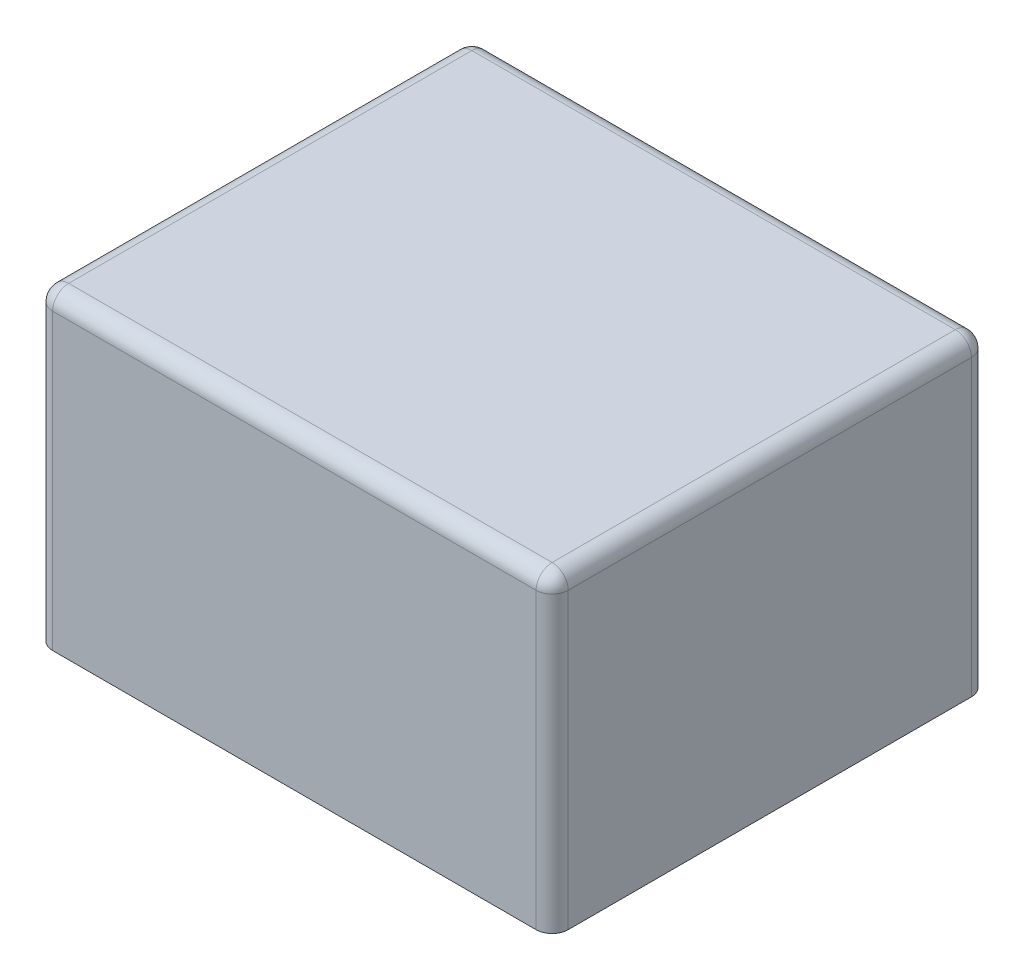
ISO-10303-21;
HEADER;
FILE_DESCRIPTION(('STEP AP214'),'2;1');
FILE_NAME('part.step','',(''),(''),'','','');
FILE_SCHEMA(('AUTOMOTIVE_DESIGN { 1 0 10303 214 1 1 1 1 }'));
ENDSEC;
DATA;
#1=APPLICATION_CONTEXT('core data for automotive mechanical design processes');
#2=APPLICATION_PROTOCOL_DEFINITION('international standard','automotive_design',2000,#1);
#3=PRODUCT_CONTEXT('',#1,'mechanical');
#4=PRODUCT('Part','Part','',(#3));
#5=PRODUCT_RELATED_PRODUCT_CATEGORY('part','',(#4));
#6=PRODUCT_DEFINITION_FORMATION('','',#4);
#7=PRODUCT_DEFINITION_CONTEXT('part definition',#1,'design');
#8=PRODUCT_DEFINITION('design','',#6,#7);
#9=PRODUCT_DEFINITION_SHAPE('','',#8);
#10=(LENGTH_UNIT() NAMED_UNIT(*) SI_UNIT(.MILLI.,.METRE.));
#11=(NAMED_UNIT(*) PLANE_ANGLE_UNIT() SI_UNIT($,.RADIAN.));
#12=(NAMED_UNIT(*) SI_UNIT($,.STERADIAN.) SOLID_ANGLE_UNIT());
#13=UNCERTAINTY_MEASURE_WITH_UNIT(LENGTH_MEASURE(1.E-05),#10,'distance_accuracy_value','');
#14=(GEOMETRIC_REPRESENTATION_CONTEXT(3) GLOBAL_UNCERTAINTY_ASSIGNED_CONTEXT((#13)) GLOBAL_UNIT_ASSIGNED_CONTEXT((#10,
#11,#12)) REPRESENTATION_CONTEXT('',''));
#15=CARTESIAN_POINT('',(0.,0.,0.));
#16=DIRECTION('',(0.,0.,1.));
#17=DIRECTION('',(1.,0.,0.));
#18=AXIS2_PLACEMENT_3D('',#15,#16,#17);
#19=CARTESIAN_POINT('',(11.05,-3.,-23.55));
#20=DIRECTION('',(0.,-1.,0.));
#21=DIRECTION('',(0.,0.,-1.));
#22=AXIS2_PLACEMENT_3D('',#19,#20,#21);
#23=PLANE('',#22);
#24=CARTESIAN_POINT('',(11.05,-3.,-23.55));
#25=DIRECTION('',(0.,-1.,0.));
#26=DIRECTION('',(0.,0.,-1.));
#27=AXIS2_PLACEMENT_3D('',#24,#25,#26);
#28=CIRCLE('',#27,0.5);
#29=CARTESIAN_POINT('',(11.05,-3.,-23.05));
#30=VERTEX_POINT('',#29);
#31=CARTESIAN_POINT('',(11.05,-3.,-24.05));
#32=VERTEX_POINT('',#31);
#33=EDGE_CURVE('E11',#30,#32,#28,.T.);
#34=ORIENTED_EDGE('',*,*,#33,.T.);
#35=CARTESIAN_POINT('',(11.05,-3.,-23.55));
#36=DIRECTION('',(0.,-1.,0.));
#37=DIRECTION('',(0.,0.,-1.));
#38=AXIS2_PLACEMENT_3D('',#35,#36,#37);
#39=CIRCLE('',#38,0.5);
#40=EDGE_CURVE('E162',#32,#30,#39,.T.);
#41=ORIENTED_EDGE('',*,*,#40,.T.);
#42=EDGE_LOOP('',(#34,#41));
#43=FACE_BOUND('',#42,.T.);
#44=ADVANCED_FACE('F17',(#43),#23,.T.);
#45=CARTESIAN_POINT('',(11.05,-3.,-23.55));
#46=DIRECTION('',(0.,1.,0.));
#47=DIRECTION('',(0.,0.,1.));
#48=AXIS2_PLACEMENT_3D('',#45,#46,#47);
#49=CYLINDRICAL_SURFACE('',#48,0.5);
#50=DIRECTION('',(0.,1.,0.));
#51=VECTOR('',#50,1.);
#52=CARTESIAN_POINT('',(11.05,-3.,-24.05));
#53=LINE('',#52,#51);
#54=CARTESIAN_POINT('',(11.05,0.,-24.05));
#55=VERTEX_POINT('',#54);
#56=EDGE_CURVE('E167',#32,#55,#53,.T.);
#57=ORIENTED_EDGE('',*,*,#56,.F.);
#58=ORIENTED_EDGE('',*,*,#33,.F.);
#59=DIRECTION('',(0.,1.,0.));
#60=VECTOR('',#59,1.);
#61=CARTESIAN_POINT('',(11.05,-3.,-23.05));
#62=LINE('',#61,#60);
#63=CARTESIAN_POINT('',(11.05,0.,-23.05));
#64=VERTEX_POINT('',#63);
#65=EDGE_CURVE('E177',#30,#64,#62,.T.);
#66=ORIENTED_EDGE('',*,*,#65,.T.);
#67=CARTESIAN_POINT('',(11.05,0.,-23.55));
#68=DIRECTION('',(0.,-1.,0.));
#69=DIRECTION('',(0.,0.,-1.));
#70=AXIS2_PLACEMENT_3D('',#67,#68,#69);
#71=CIRCLE('',#70,0.5);
#72=EDGE_CURVE('E169',#64,#55,#71,.T.);
#73=ORIENTED_EDGE('',*,*,#72,.T.);
#74=EDGE_LOOP('',(#57,#58,#66,#73));
#75=FACE_BOUND('',#74,.T.);
#76=ADVANCED_FACE('F168',(#75),#49,.T.);
#77=CARTESIAN_POINT('',(21.05,-3.,-23.55));
#78=DIRECTION('',(0.,-1.,0.));
#79=DIRECTION('',(0.,0.,-1.));
#80=AXIS2_PLACEMENT_3D('',#77,#78,#79);
#81=PLANE('',#80);
#82=CARTESIAN_POINT('',(21.05,-3.,-23.55));
#83=DIRECTION('',(0.,-1.,0.));
#84=DIRECTION('',(0.,0.,-1.));
#85=AXIS2_PLACEMENT_3D('',#82,#83,#84);
#86=CIRCLE('',#85,0.5);
#87=CARTESIAN_POINT('',(21.05,-3.,-23.05));
#88=VERTEX_POINT('',#87);
#89=CARTESIAN_POINT('',(21.05,-3.,-24.05));
#90=VERTEX_POINT('',#89);
#91=EDGE_CURVE('E28',#88,#90,#86,.T.);
#92=ORIENTED_EDGE('',*,*,#91,.T.);
#93=CARTESIAN_POINT('',(21.05,-3.,-23.55));
#94=DIRECTION('',(0.,-1.,0.));
#95=DIRECTION('',(0.,0.,-1.));
#96=AXIS2_PLACEMENT_3D('',#93,#94,#95);
#97=CIRCLE('',#96,0.5);
#98=EDGE_CURVE('E226',#90,#88,#97,.T.);
#99=ORIENTED_EDGE('',*,*,#98,.T.);
#100=EDGE_LOOP('',(#92,#99));
#101=FACE_BOUND('',#100,.T.);
#102=ADVANCED_FACE('F421',(#101),#81,.T.);
#103=CARTESIAN_POINT('',(21.05,-3.,-23.55));
#104=DIRECTION('',(0.,1.,0.));
#105=DIRECTION('',(0.,0.,1.));
#106=AXIS2_PLACEMENT_3D('',#103,#104,#105);
#107=CYLINDRICAL_SURFACE('',#106,0.5);
#108=DIRECTION('',(0.,1.,0.));
#109=VECTOR('',#108,1.);
#110=CARTESIAN_POINT('',(21.05,-3.,-24.05));
#111=LINE('',#110,#109);
#112=CARTESIAN_POINT('',(21.05,0.,-24.05));
#113=VERTEX_POINT('',#112);
#114=EDGE_CURVE('E268',#90,#113,#111,.T.);
#115=ORIENTED_EDGE('',*,*,#114,.F.);
#116=ORIENTED_EDGE('',*,*,#91,.F.);
#117=DIRECTION('',(0.,1.,0.));
#118=VECTOR('',#117,1.);
#119=CARTESIAN_POINT('',(21.05,-3.,-23.05));
#120=LINE('',#119,#118);
#121=CARTESIAN_POINT('',(21.05,0.,-23.05));
#122=VERTEX_POINT('',#121);
#123=EDGE_CURVE('E343',#88,#122,#120,.T.);
#124=ORIENTED_EDGE('',*,*,#123,.T.);
#125=CARTESIAN_POINT('',(21.05,0.,-23.55));
#126=DIRECTION('',(0.,-1.,0.));
#127=DIRECTION('',(0.,0.,-1.));
#128=AXIS2_PLACEMENT_3D('',#125,#126,#127);
#129=CIRCLE('',#128,0.5);
#130=EDGE_CURVE('E188',#122,#113,#129,.T.);
#131=ORIENTED_EDGE('',*,*,#130,.T.);
#132=EDGE_LOOP('',(#115,#116,#124,#131));
#133=FACE_BOUND('',#132,.T.);
#134=ADVANCED_FACE('F416',(#133),#107,.T.);
#135=CARTESIAN_POINT('',(26.05,-3.,-3.55));
#136=DIRECTION('',(0.,-1.,0.));
#137=DIRECTION('',(0.,0.,-1.));
#138=AXIS2_PLACEMENT_3D('',#135,#136,#137);
#139=PLANE('',#138);
#140=CARTESIAN_POINT('',(26.05,-3.,-3.55));
#141=DIRECTION('',(0.,-1.,0.));
#142=DIRECTION('',(0.,0.,-1.));
#143=AXIS2_PLACEMENT_3D('',#140,#141,#142);
#144=CIRCLE('',#143,0.5);
#145=CARTESIAN_POINT('',(26.05,-3.,-3.05));
#146=VERTEX_POINT('',#145);
#147=CARTESIAN_POINT('',(26.05,-3.,-4.05));
#148=VERTEX_POINT('',#147);
#149=EDGE_CURVE('E303',#146,#148,#144,.T.);
#150=ORIENTED_EDGE('',*,*,#149,.T.);
#151=CARTESIAN_POINT('',(26.05,-3.,-3.55));
#152=DIRECTION('',(0.,-1.,0.));
#153=DIRECTION('',(0.,0.,-1.));
#154=AXIS2_PLACEMENT_3D('',#151,#152,#153);
#155=CIRCLE('',#154,0.5);
#156=EDGE_CURVE('E352',#148,#146,#155,.T.);
#157=ORIENTED_EDGE('',*,*,#156,.T.);
#158=EDGE_LOOP('',(#150,#157));
#159=FACE_BOUND('',#158,.T.);
#160=ADVANCED_FACE('F429',(#159),#139,.T.);
#161=CARTESIAN_POINT('',(26.05,-3.,-3.55));
#162=DIRECTION('',(0.,1.,0.));
#163=DIRECTION('',(0.,0.,1.));
#164=AXIS2_PLACEMENT_3D('',#161,#162,#163);
#165=CYLINDRICAL_SURFACE('',#164,0.5);
#166=DIRECTION('',(0.,1.,0.));
#167=VECTOR('',#166,1.);
#168=CARTESIAN_POINT('',(26.05,-3.,-4.05));
#169=LINE('',#168,#167);
#170=CARTESIAN_POINT('',(26.05,0.,-4.05));
#171=VERTEX_POINT('',#170);
#172=EDGE_CURVE('E21',#148,#171,#169,.T.);
#173=ORIENTED_EDGE('',*,*,#172,.F.);
#174=ORIENTED_EDGE('',*,*,#149,.F.);
#175=DIRECTION('',(0.,1.,0.));
#176=VECTOR('',#175,1.);
#177=CARTESIAN_POINT('',(26.05,-3.,-3.05));
#178=LINE('',#177,#176);
#179=CARTESIAN_POINT('',(26.05,0.,-3.05));
#180=VERTEX_POINT('',#179);
#181=EDGE_CURVE('E242',#146,#180,#178,.T.);
#182=ORIENTED_EDGE('',*,*,#181,.T.);
#183=CARTESIAN_POINT('',(26.05,0.,-3.55));
#184=DIRECTION('',(0.,-1.,0.));
#185=DIRECTION('',(0.,0.,-1.));
#186=AXIS2_PLACEMENT_3D('',#183,#184,#185);
#187=CIRCLE('',#186,0.5);
#188=EDGE_CURVE('E206',#180,#171,#187,.T.);
#189=ORIENTED_EDGE('',*,*,#188,.T.);
#190=EDGE_LOOP('',(#173,#174,#182,#189));
#191=FACE_BOUND('',#190,.T.);
#192=ADVANCED_FACE('F401',(#191),#165,.T.);
#193=CARTESIAN_POINT('',(6.05,-3.,-3.55));
#194=DIRECTION('',(0.,-1.,0.));
#195=DIRECTION('',(0.,0.,-1.));
#196=AXIS2_PLACEMENT_3D('',#193,#194,#195);
#197=PLANE('',#196);
#198=CARTESIAN_POINT('',(6.05,-3.,-3.55));
#199=DIRECTION('',(0.,-1.,0.));
#200=DIRECTION('',(0.,0.,-1.));
#201=AXIS2_PLACEMENT_3D('',#198,#199,#200);
#202=CIRCLE('',#201,0.5);
#203=CARTESIAN_POINT('',(6.05,-3.,-3.05));
#204=VERTEX_POINT('',#203);
#205=CARTESIAN_POINT('',(6.05,-3.,-4.05));
#206=VERTEX_POINT('',#205);
#207=EDGE_CURVE('E299',#204,#206,#202,.T.);
#208=ORIENTED_EDGE('',*,*,#207,.T.);
#209=CARTESIAN_POINT('',(6.05,-3.,-3.55));
#210=DIRECTION('',(0.,-1.,0.));
#211=DIRECTION('',(0.,0.,-1.));
#212=AXIS2_PLACEMENT_3D('',#209,#210,#211);
#213=CIRCLE('',#212,0.5);
#214=EDGE_CURVE('E276',#206,#204,#213,.T.);
#215=ORIENTED_EDGE('',*,*,#214,.T.);
#216=EDGE_LOOP('',(#208,#215));
#217=FACE_BOUND('',#216,.T.);
#218=ADVANCED_FACE('F453',(#217),#197,.T.);
#219=CARTESIAN_POINT('',(6.05,-3.,-3.55));
#220=DIRECTION('',(0.,1.,0.));
#221=DIRECTION('',(0.,0.,1.));
#222=AXIS2_PLACEMENT_3D('',#219,#220,#221);
#223=CYLINDRICAL_SURFACE('',#222,0.5);
#224=DIRECTION('',(0.,1.,0.));
#225=VECTOR('',#224,1.);
#226=CARTESIAN_POINT('',(6.05,-3.,-4.05));
#227=LINE('',#226,#225);
#228=CARTESIAN_POINT('',(6.05,0.,-4.05));
#229=VERTEX_POINT('',#228);
#230=EDGE_CURVE('E285',#206,#229,#227,.T.);
#231=ORIENTED_EDGE('',*,*,#230,.F.);
#232=ORIENTED_EDGE('',*,*,#207,.F.);
#233=DIRECTION('',(0.,1.,0.));
#234=VECTOR('',#233,1.);
#235=CARTESIAN_POINT('',(6.05,-3.,-3.05));
#236=LINE('',#235,#234);
#237=CARTESIAN_POINT('',(6.05,0.,-3.05));
#238=VERTEX_POINT('',#237);
#239=EDGE_CURVE('E255',#204,#238,#236,.T.);
#240=ORIENTED_EDGE('',*,*,#239,.T.);
#241=CARTESIAN_POINT('',(6.05,0.,-3.55));
#242=DIRECTION('',(0.,-1.,0.));
#243=DIRECTION('',(0.,0.,-1.));
#244=AXIS2_PLACEMENT_3D('',#241,#242,#243);
#245=CIRCLE('',#244,0.5);
#246=EDGE_CURVE('E185',#238,#229,#245,.T.);
#247=ORIENTED_EDGE('',*,*,#246,.T.);
#248=EDGE_LOOP('',(#231,#232,#240,#247));
#249=FACE_BOUND('',#248,.T.);
#250=ADVANCED_FACE('F446',(#249),#223,.T.);
#251=CARTESIAN_POINT('',(0.,18.3,-26.1));
#252=DIRECTION('',(-1.,0.,0.));
#253=DIRECTION('',(0.,0.,1.));
#254=AXIS2_PLACEMENT_3D('',#251,#252,#253);
#255=CYLINDRICAL_SURFACE('',#254,1.);
#256=CARTESIAN_POINT('',(31.1,18.3,-26.1));
#257=DIRECTION('',(-1.,0.,0.));
#258=DIRECTION('',(0.,0.,-1.));
#259=AXIS2_PLACEMENT_3D('',#256,#257,#258);
#260=CIRCLE('',#259,1.);
#261=CARTESIAN_POINT('',(31.1,19.3,-26.1));
#262=VERTEX_POINT('',#261);
#263=CARTESIAN_POINT('',(31.1,18.3,-27.1));
#264=VERTEX_POINT('',#263);
#265=EDGE_CURVE('E292',#262,#264,#260,.T.);
#266=ORIENTED_EDGE('',*,*,#265,.T.);
#267=DIRECTION('',(1.,0.,0.));
#268=VECTOR('',#267,1.);
#269=CARTESIAN_POINT('',(0.,18.3,-27.1));
#270=LINE('',#269,#268);
#271=CARTESIAN_POINT('',(1.,18.3,-27.1));
#272=VERTEX_POINT('',#271);
#273=EDGE_CURVE('E254',#272,#264,#270,.T.);
#274=ORIENTED_EDGE('',*,*,#273,.F.);
#275=CARTESIAN_POINT('',(1.,18.3,-26.1));
#276=DIRECTION('',(1.,0.,0.));
#277=DIRECTION('',(0.,0.,1.));
#278=AXIS2_PLACEMENT_3D('',#275,#276,#277);
#279=CIRCLE('',#278,1.);
#280=CARTESIAN_POINT('',(1.,19.3,-26.1));
#281=VERTEX_POINT('',#280);
#282=EDGE_CURVE('E295',#272,#281,#279,.T.);
#283=ORIENTED_EDGE('',*,*,#282,.T.);
#284=DIRECTION('',(-1.,0.,0.));
#285=VECTOR('',#284,1.);
#286=CARTESIAN_POINT('',(0.,19.3,-26.1));
#287=LINE('',#286,#285);
#288=EDGE_CURVE('E214',#262,#281,#287,.T.);
#289=ORIENTED_EDGE('',*,*,#288,.F.);
#290=EDGE_LOOP('',(#266,#274,#283,#289));
#291=FACE_BOUND('',#290,.T.);
#292=ADVANCED_FACE('F442',(#291),#255,.T.);
#293=CARTESIAN_POINT('',(1.,18.3,-26.1));
#294=DIRECTION('',(0.,1.,0.));
#295=DIRECTION('',(0.,0.,1.));
#296=AXIS2_PLACEMENT_3D('',#293,#294,#295);
#297=SPHERICAL_SURFACE('',#296,1.);
#298=CARTESIAN_POINT('',(1.,18.3,-26.1));
#299=DIRECTION('',(0.,1.,0.));
#300=DIRECTION('',(0.,0.,1.));
#301=AXIS2_PLACEMENT_3D('',#298,#299,#300);
#302=CIRCLE('',#301,1.);
#303=CARTESIAN_POINT('',(0.,18.3,-26.1));
#304=VERTEX_POINT('',#303);
#305=EDGE_CURVE('E296',#272,#304,#302,.T.);
#306=ORIENTED_EDGE('',*,*,#305,.T.);
#307=CARTESIAN_POINT('',(1.,18.3,-26.1));
#308=DIRECTION('',(0.,0.,-1.));
#309=DIRECTION('',(-1.,0.,0.));
#310=AXIS2_PLACEMENT_3D('',#307,#308,#309);
#311=CIRCLE('',#310,1.);
#312=EDGE_CURVE('E230',#304,#281,#311,.T.);
#313=ORIENTED_EDGE('',*,*,#312,.T.);
#314=ORIENTED_EDGE('',*,*,#282,.F.);
#315=EDGE_LOOP('',(#306,#313,#314));
#316=FACE_BOUND('',#315,.T.);
#317=ADVANCED_FACE('F445',(#316),#297,.T.);
#318=CARTESIAN_POINT('',(31.1,18.3,-26.1));
#319=DIRECTION('',(0.,1.,0.));
#320=DIRECTION('',(0.,0.,-1.));
#321=AXIS2_PLACEMENT_3D('',#318,#319,#320);
#322=SPHERICAL_SURFACE('',#321,1.);
#323=CARTESIAN_POINT('',(31.1,18.3,-26.1));
#324=DIRECTION('',(0.,0.,-1.));
#325=DIRECTION('',(-1.,0.,0.));
#326=AXIS2_PLACEMENT_3D('',#323,#324,#325);
#327=CIRCLE('',#326,1.);
#328=CARTESIAN_POINT('',(32.1,18.3,-26.1));
#329=VERTEX_POINT('',#328);
#330=EDGE_CURVE('E227',#262,#329,#327,.T.);
#331=ORIENTED_EDGE('',*,*,#330,.T.);
#332=CARTESIAN_POINT('',(31.1,18.3,-26.1));
#333=DIRECTION('',(0.,1.,0.));
#334=DIRECTION('',(0.,0.,1.));
#335=AXIS2_PLACEMENT_3D('',#332,#333,#334);
#336=CIRCLE('',#335,1.);
#337=EDGE_CURVE('E231',#329,#264,#336,.T.);
#338=ORIENTED_EDGE('',*,*,#337,.T.);
#339=ORIENTED_EDGE('',*,*,#265,.F.);
#340=EDGE_LOOP('',(#331,#338,#339));
#341=FACE_BOUND('',#340,.T.);
#342=ADVANCED_FACE('F448',(#341),#322,.T.);
#343=CARTESIAN_POINT('',(1.,19.3,-26.1));
#344=DIRECTION('',(0.,-1.,0.));
#345=DIRECTION('',(0.,0.,-1.));
#346=AXIS2_PLACEMENT_3D('',#343,#344,#345);
#347=CYLINDRICAL_SURFACE('',#346,1.);
#348=CARTESIAN_POINT('',(1.,0.,-26.1));
#349=DIRECTION('',(0.,-1.,0.));
#350=DIRECTION('',(0.,0.,-1.));
#351=AXIS2_PLACEMENT_3D('',#348,#349,#350);
#352=CIRCLE('',#351,1.);
#353=CARTESIAN_POINT('',(0.,0.,-26.1));
#354=VERTEX_POINT('',#353);
#355=CARTESIAN_POINT('',(1.,0.,-27.1));
#356=VERTEX_POINT('',#355);
#357=EDGE_CURVE('E195',#354,#356,#352,.T.);
#358=ORIENTED_EDGE('',*,*,#357,.F.);
#359=DIRECTION('',(0.,-1.,0.));
#360=VECTOR('',#359,1.);
#361=CARTESIAN_POINT('',(0.,19.3,-26.1));
#362=LINE('',#361,#360);
#363=EDGE_CURVE('E264',#304,#354,#362,.T.);
#364=ORIENTED_EDGE('',*,*,#363,.F.);
#365=ORIENTED_EDGE('',*,*,#305,.F.);
#366=DIRECTION('',(0.,1.,0.));
#367=VECTOR('',#366,1.);
#368=CARTESIAN_POINT('',(1.,19.3,-27.1));
#369=LINE('',#368,#367);
#370=EDGE_CURVE('E289',#356,#272,#369,.T.);
#371=ORIENTED_EDGE('',*,*,#370,.F.);
#372=EDGE_LOOP('',(#358,#364,#365,#371));
#373=FACE_BOUND('',#372,.T.);
#374=ADVANCED_FACE('F451',(#373),#347,.T.);
#375=CARTESIAN_POINT('',(1.,18.3,0.));
#376=DIRECTION('',(0.,0.,1.));
#377=DIRECTION('',(1.,0.,0.));
#378=AXIS2_PLACEMENT_3D('',#375,#376,#377);
#379=CYLINDRICAL_SURFACE('',#378,1.);
#380=CARTESIAN_POINT('',(1.,18.3,-1.));
#381=DIRECTION('',(0.,0.,-1.));
#382=DIRECTION('',(1.,0.,0.));
#383=AXIS2_PLACEMENT_3D('',#380,#381,#382);
#384=CIRCLE('',#383,1.);
#385=CARTESIAN_POINT('',(0.,18.3,-1.));
#386=VERTEX_POINT('',#385);
#387=CARTESIAN_POINT('',(1.,19.3,-1.));
#388=VERTEX_POINT('',#387);
#389=EDGE_CURVE('E42',#386,#388,#384,.T.);
#390=ORIENTED_EDGE('',*,*,#389,.T.);
#391=DIRECTION('',(0.,0.,1.));
#392=VECTOR('',#391,1.);
#393=CARTESIAN_POINT('',(1.,19.3,0.));
#394=LINE('',#393,#392);
#395=EDGE_CURVE('E218',#281,#388,#394,.T.);
#396=ORIENTED_EDGE('',*,*,#395,.F.);
#397=ORIENTED_EDGE('',*,*,#312,.F.);
#398=DIRECTION('',(0.,0.,-1.));
#399=VECTOR('',#398,1.);
#400=CARTESIAN_POINT('',(0.,18.3,0.));
#401=LINE('',#400,#399);
#402=EDGE_CURVE('E259',#386,#304,#401,.T.);
#403=ORIENTED_EDGE('',*,*,#402,.F.);
#404=EDGE_LOOP('',(#390,#396,#397,#403));
#405=FACE_BOUND('',#404,.T.);
#406=ADVANCED_FACE('F459',(#405),#379,.T.);
#407=CARTESIAN_POINT('',(31.1,18.3,0.));
#408=DIRECTION('',(0.,0.,-1.));
#409=DIRECTION('',(-1.,0.,0.));
#410=AXIS2_PLACEMENT_3D('',#407,#408,#409);
#411=CYLINDRICAL_SURFACE('',#410,1.);
#412=CARTESIAN_POINT('',(31.1,18.3,-1.));
#413=DIRECTION('',(0.,0.,-1.));
#414=DIRECTION('',(1.,0.,0.));
#415=AXIS2_PLACEMENT_3D('',#412,#413,#414);
#416=CIRCLE('',#415,1.);
#417=CARTESIAN_POINT('',(31.1,19.3,-1.));
#418=VERTEX_POINT('',#417);
#419=CARTESIAN_POINT('',(32.1,18.3,-1.));
#420=VERTEX_POINT('',#419);
#421=EDGE_CURVE('E223',#418,#420,#416,.T.);
#422=ORIENTED_EDGE('',*,*,#421,.T.);
#423=DIRECTION('',(0.,0.,1.));
#424=VECTOR('',#423,1.);
#425=CARTESIAN_POINT('',(32.1,18.3,0.));
#426=LINE('',#425,#424);
#427=EDGE_CURVE('E203',#329,#420,#426,.T.);
#428=ORIENTED_EDGE('',*,*,#427,.F.);
#429=ORIENTED_EDGE('',*,*,#330,.F.);
#430=DIRECTION('',(0.,0.,-1.));
#431=VECTOR('',#430,1.);
#432=CARTESIAN_POINT('',(31.1,19.3,0.));
#433=LINE('',#432,#431);
#434=EDGE_CURVE('E219',#418,#262,#433,.T.);
#435=ORIENTED_EDGE('',*,*,#434,.F.);
#436=EDGE_LOOP('',(#422,#428,#429,#435));
#437=FACE_BOUND('',#436,.T.);
#438=ADVANCED_FACE('F461',(#437),#411,.T.);
#439=CARTESIAN_POINT('',(31.1,19.3,-26.1));
#440=DIRECTION('',(0.,-1.,0.));
#441=DIRECTION('',(0.,0.,-1.));
#442=AXIS2_PLACEMENT_3D('',#439,#440,#441);
#443=CYLINDRICAL_SURFACE('',#442,1.);
#444=CARTESIAN_POINT('',(31.1,0.,-26.1));
#445=DIRECTION('',(0.,-1.,0.));
#446=DIRECTION('',(0.,0.,-1.));
#447=AXIS2_PLACEMENT_3D('',#444,#445,#446);
#448=CIRCLE('',#447,1.);
#449=CARTESIAN_POINT('',(31.1,0.,-27.1));
#450=VERTEX_POINT('',#449);
#451=CARTESIAN_POINT('',(32.1,0.,-26.1));
#452=VERTEX_POINT('',#451);
#453=EDGE_CURVE('E237',#450,#452,#448,.T.);
#454=ORIENTED_EDGE('',*,*,#453,.F.);
#455=DIRECTION('',(0.,-1.,0.));
#456=VECTOR('',#455,1.);
#457=CARTESIAN_POINT('',(31.1,19.3,-27.1));
#458=LINE('',#457,#456);
#459=EDGE_CURVE('E249',#264,#450,#458,.T.);
#460=ORIENTED_EDGE('',*,*,#459,.F.);
#461=ORIENTED_EDGE('',*,*,#337,.F.);
#462=DIRECTION('',(0.,1.,0.));
#463=VECTOR('',#462,1.);
#464=CARTESIAN_POINT('',(32.1,19.3,-26.1));
#465=LINE('',#464,#463);
#466=EDGE_CURVE('E200',#452,#329,#465,.T.);
#467=ORIENTED_EDGE('',*,*,#466,.F.);
#468=EDGE_LOOP('',(#454,#460,#461,#467));
#469=FACE_BOUND('',#468,.T.);
#470=ADVANCED_FACE('F464',(#469),#443,.T.);
#471=CARTESIAN_POINT('',(1.,18.3,-1.));
#472=DIRECTION('',(0.,1.,0.));
#473=DIRECTION('',(1.,0.,0.));
#474=AXIS2_PLACEMENT_3D('',#471,#472,#473);
#475=SPHERICAL_SURFACE('',#474,1.);
#476=CARTESIAN_POINT('',(1.,18.3,-1.));
#477=DIRECTION('',(0.,1.,0.));
#478=DIRECTION('',(0.,0.,1.));
#479=AXIS2_PLACEMENT_3D('',#476,#477,#478);
#480=CIRCLE('',#479,1.);
#481=CARTESIAN_POINT('',(1.,18.3,0.));
#482=VERTEX_POINT('',#481);
#483=EDGE_CURVE('E213',#386,#482,#480,.T.);
#484=ORIENTED_EDGE('',*,*,#483,.T.);
#485=CARTESIAN_POINT('',(1.,18.3,-1.));
#486=DIRECTION('',(-1.,0.,0.));
#487=DIRECTION('',(0.,0.,1.));
#488=AXIS2_PLACEMENT_3D('',#485,#486,#487);
#489=CIRCLE('',#488,1.);
#490=EDGE_CURVE('E190',#482,#388,#489,.T.);
#491=ORIENTED_EDGE('',*,*,#490,.T.);
#492=ORIENTED_EDGE('',*,*,#389,.F.);
#493=EDGE_LOOP('',(#484,#491,#492));
#494=FACE_BOUND('',#493,.T.);
#495=ADVANCED_FACE('F468',(#494),#475,.T.);
#496=CARTESIAN_POINT('',(31.1,18.3,-1.));
#497=DIRECTION('',(0.,1.,0.));
#498=DIRECTION('',(1.,0.,0.));
#499=AXIS2_PLACEMENT_3D('',#496,#497,#498);
#500=SPHERICAL_SURFACE('',#499,1.);
#501=CARTESIAN_POINT('',(31.1,18.3,-1.));
#502=DIRECTION('',(1.,0.,0.));
#503=DIRECTION('',(0.,0.,-1.));
#504=AXIS2_PLACEMENT_3D('',#501,#502,#503);
#505=CIRCLE('',#504,1.);
#506=CARTESIAN_POINT('',(31.1,18.3,0.));
#507=VERTEX_POINT('',#506);
#508=EDGE_CURVE('E193',#418,#507,#505,.T.);
#509=ORIENTED_EDGE('',*,*,#508,.T.);
#510=CARTESIAN_POINT('',(31.1,18.3,-1.));
#511=DIRECTION('',(0.,1.,0.));
#512=DIRECTION('',(0.,0.,1.));
#513=AXIS2_PLACEMENT_3D('',#510,#511,#512);
#514=CIRCLE('',#513,1.);
#515=EDGE_CURVE('E194',#507,#420,#514,.T.);
#516=ORIENTED_EDGE('',*,*,#515,.T.);
#517=ORIENTED_EDGE('',*,*,#421,.F.);
#518=EDGE_LOOP('',(#509,#516,#517));
#519=FACE_BOUND('',#518,.T.);
#520=ADVANCED_FACE('F470',(#519),#500,.T.);
#521=CARTESIAN_POINT('',(1.,19.3,-1.));
#522=DIRECTION('',(0.,-1.,0.));
#523=DIRECTION('',(0.,0.,-1.));
#524=AXIS2_PLACEMENT_3D('',#521,#522,#523);
#525=CYLINDRICAL_SURFACE('',#524,1.);
#526=CARTESIAN_POINT('',(1.,0.,-1.));
#527=DIRECTION('',(0.,-1.,0.));
#528=DIRECTION('',(0.,0.,-1.));
#529=AXIS2_PLACEMENT_3D('',#526,#527,#528);
#530=CIRCLE('',#529,1.);
#531=CARTESIAN_POINT('',(1.,0.,0.));
#532=VERTEX_POINT('',#531);
#533=CARTESIAN_POINT('',(0.,0.,-1.));
#534=VERTEX_POINT('',#533);
#535=EDGE_CURVE('E199',#532,#534,#530,.T.);
#536=ORIENTED_EDGE('',*,*,#535,.F.);
#537=DIRECTION('',(0.,-1.,0.));
#538=VECTOR('',#537,1.);
#539=CARTESIAN_POINT('',(1.,19.3,0.));
#540=LINE('',#539,#538);
#541=EDGE_CURVE('E281',#482,#532,#540,.T.);
#542=ORIENTED_EDGE('',*,*,#541,.F.);
#543=ORIENTED_EDGE('',*,*,#483,.F.);
#544=DIRECTION('',(0.,1.,0.));
#545=VECTOR('',#544,1.);
#546=CARTESIAN_POINT('',(0.,19.3,-1.));
#547=LINE('',#546,#545);
#548=EDGE_CURVE('E248',#534,#386,#547,.T.);
#549=ORIENTED_EDGE('',*,*,#548,.F.);
#550=EDGE_LOOP('',(#536,#542,#543,#549));
#551=FACE_BOUND('',#550,.T.);
#552=ADVANCED_FACE('F472',(#551),#525,.T.);
#553=CARTESIAN_POINT('',(0.,18.3,-1.));
#554=DIRECTION('',(1.,0.,0.));
#555=DIRECTION('',(0.,0.,-1.));
#556=AXIS2_PLACEMENT_3D('',#553,#554,#555);
#557=CYLINDRICAL_SURFACE('',#556,1.);
#558=ORIENTED_EDGE('',*,*,#490,.F.);
#559=DIRECTION('',(-1.,0.,0.));
#560=VECTOR('',#559,1.);
#561=CARTESIAN_POINT('',(0.,18.3,0.));
#562=LINE('',#561,#560);
#563=EDGE_CURVE('E277',#507,#482,#562,.T.);
#564=ORIENTED_EDGE('',*,*,#563,.F.);
#565=ORIENTED_EDGE('',*,*,#508,.F.);
#566=DIRECTION('',(1.,0.,0.));
#567=VECTOR('',#566,1.);
#568=CARTESIAN_POINT('',(0.,19.3,-1.));
#569=LINE('',#568,#567);
#570=EDGE_CURVE('E189',#388,#418,#569,.T.);
#571=ORIENTED_EDGE('',*,*,#570,.F.);
#572=EDGE_LOOP('',(#558,#564,#565,#571));
#573=FACE_BOUND('',#572,.T.);
#574=ADVANCED_FACE('F495',(#573),#557,.T.);
#575=CARTESIAN_POINT('',(31.1,19.3,-1.));
#576=DIRECTION('',(0.,-1.,0.));
#577=DIRECTION('',(0.,0.,-1.));
#578=AXIS2_PLACEMENT_3D('',#575,#576,#577);
#579=CYLINDRICAL_SURFACE('',#578,1.);
#580=CARTESIAN_POINT('',(31.1,0.,-1.));
#581=DIRECTION('',(0.,-1.,0.));
#582=DIRECTION('',(0.,0.,-1.));
#583=AXIS2_PLACEMENT_3D('',#580,#581,#582);
#584=CIRCLE('',#583,1.);
#585=CARTESIAN_POINT('',(32.1,0.,-1.));
#586=VERTEX_POINT('',#585);
#587=CARTESIAN_POINT('',(31.1,0.,0.));
#588=VERTEX_POINT('',#587);
#589=EDGE_CURVE('E234',#586,#588,#584,.T.);
#590=ORIENTED_EDGE('',*,*,#589,.F.);
#591=DIRECTION('',(0.,-1.,0.));
#592=VECTOR('',#591,1.);
#593=CARTESIAN_POINT('',(32.1,19.3,-1.));
#594=LINE('',#593,#592);
#595=EDGE_CURVE('E320',#420,#586,#594,.T.);
#596=ORIENTED_EDGE('',*,*,#595,.F.);
#597=ORIENTED_EDGE('',*,*,#515,.F.);
#598=DIRECTION('',(0.,1.,0.));
#599=VECTOR('',#598,1.);
#600=CARTESIAN_POINT('',(31.1,19.3,0.));
#601=LINE('',#600,#599);
#602=EDGE_CURVE('E247',#588,#507,#601,.T.);
#603=ORIENTED_EDGE('',*,*,#602,.F.);
#604=EDGE_LOOP('',(#590,#596,#597,#603));
#605=FACE_BOUND('',#604,.T.);
#606=ADVANCED_FACE('F407',(#605),#579,.T.);
#607=CARTESIAN_POINT('',(0.,0.,0.));
#608=DIRECTION('',(0.,-1.,0.));
#609=DIRECTION('',(0.,0.,-1.));
#610=AXIS2_PLACEMENT_3D('',#607,#608,#609);
#611=PLANE('',#610);
#612=DIRECTION('',(-1.,0.,0.));
#613=VECTOR('',#612,1.);
#614=CARTESIAN_POINT('',(0.,0.,-27.1));
#615=LINE('',#614,#613);
#616=EDGE_CURVE('E253',#450,#356,#615,.T.);
#617=ORIENTED_EDGE('',*,*,#616,.F.);
#618=ORIENTED_EDGE('',*,*,#453,.T.);
#619=DIRECTION('',(0.,0.,-1.));
#620=VECTOR('',#619,1.);
#621=CARTESIAN_POINT('',(32.1,0.,0.));
#622=LINE('',#621,#620);
#623=EDGE_CURVE('E204',#586,#452,#622,.T.);
#624=ORIENTED_EDGE('',*,*,#623,.F.);
#625=ORIENTED_EDGE('',*,*,#589,.T.);
#626=DIRECTION('',(1.,0.,0.));
#627=VECTOR('',#626,1.);
#628=CARTESIAN_POINT('',(0.,0.,0.));
#629=LINE('',#628,#627);
#630=EDGE_CURVE('E243',#532,#588,#629,.T.);
#631=ORIENTED_EDGE('',*,*,#630,.F.);
#632=ORIENTED_EDGE('',*,*,#535,.T.);
#633=DIRECTION('',(0.,0.,1.));
#634=VECTOR('',#633,1.);
#635=CARTESIAN_POINT('',(0.,0.,0.));
#636=LINE('',#635,#634);
#637=EDGE_CURVE('E272',#354,#534,#636,.T.);
#638=ORIENTED_EDGE('',*,*,#637,.F.);
#639=ORIENTED_EDGE('',*,*,#357,.T.);
#640=EDGE_LOOP('',(#617,#618,#624,#625,#631,#632,#638,#639));
#641=FACE_BOUND('',#640,.T.);
#642=ORIENTED_EDGE('',*,*,#246,.F.);
#643=CARTESIAN_POINT('',(6.05,0.,-3.55));
#644=DIRECTION('',(0.,-1.,0.));
#645=DIRECTION('',(0.,0.,-1.));
#646=AXIS2_PLACEMENT_3D('',#643,#644,#645);
#647=CIRCLE('',#646,0.5);
#648=EDGE_CURVE('E260',#229,#238,#647,.T.);
#649=ORIENTED_EDGE('',*,*,#648,.F.);
#650=EDGE_LOOP('',(#642,#649));
#651=FACE_BOUND('',#650,.T.);
#652=ORIENTED_EDGE('',*,*,#188,.F.);
#653=CARTESIAN_POINT('',(26.05,0.,-3.55));
#654=DIRECTION('',(0.,-1.,0.));
#655=DIRECTION('',(0.,0.,-1.));
#656=AXIS2_PLACEMENT_3D('',#653,#654,#655);
#657=CIRCLE('',#656,0.5);
#658=EDGE_CURVE('E238',#171,#180,#657,.T.);
#659=ORIENTED_EDGE('',*,*,#658,.F.);
#660=EDGE_LOOP('',(#652,#659));
#661=FACE_BOUND('',#660,.T.);
#662=ORIENTED_EDGE('',*,*,#130,.F.);
#663=CARTESIAN_POINT('',(21.05,0.,-23.55));
#664=DIRECTION('',(0.,-1.,0.));
#665=DIRECTION('',(0.,0.,-1.));
#666=AXIS2_PLACEMENT_3D('',#663,#664,#665);
#667=CIRCLE('',#666,0.5);
#668=EDGE_CURVE('E340',#113,#122,#667,.T.);
#669=ORIENTED_EDGE('',*,*,#668,.F.);
#670=EDGE_LOOP('',(#662,#669));
#671=FACE_BOUND('',#670,.T.);
#672=ORIENTED_EDGE('',*,*,#72,.F.);
#673=CARTESIAN_POINT('',(11.05,0.,-23.55));
#674=DIRECTION('',(0.,-1.,0.));
#675=DIRECTION('',(0.,0.,-1.));
#676=AXIS2_PLACEMENT_3D('',#673,#674,#675);
#677=CIRCLE('',#676,0.5);
#678=EDGE_CURVE('E174',#55,#64,#677,.T.);
#679=ORIENTED_EDGE('',*,*,#678,.F.);
#680=EDGE_LOOP('',(#672,#679));
#681=FACE_BOUND('',#680,.T.);
#682=ADVANCED_FACE('F403',(#641,#651,#661,#671,#681),#611,.T.);
#683=CARTESIAN_POINT('',(0.,19.3,0.));
#684=DIRECTION('',(0.,-1.,0.));
#685=DIRECTION('',(0.,0.,-1.));
#686=AXIS2_PLACEMENT_3D('',#683,#684,#685);
#687=PLANE('',#686);
#688=ORIENTED_EDGE('',*,*,#434,.T.);
#689=ORIENTED_EDGE('',*,*,#288,.T.);
#690=ORIENTED_EDGE('',*,*,#395,.T.);
#691=ORIENTED_EDGE('',*,*,#570,.T.);
#692=EDGE_LOOP('',(#688,#689,#690,#691));
#693=FACE_BOUND('',#692,.T.);
#694=ADVANCED_FACE('F406',(#693),#687,.F.);
#695=CARTESIAN_POINT('',(0.,19.3,-27.1));
#696=DIRECTION('',(0.,0.,1.));
#697=DIRECTION('',(1.,0.,0.));
#698=AXIS2_PLACEMENT_3D('',#695,#696,#697);
#699=PLANE('',#698);
#700=ORIENTED_EDGE('',*,*,#273,.T.);
#701=ORIENTED_EDGE('',*,*,#459,.T.);
#702=ORIENTED_EDGE('',*,*,#616,.T.);
#703=ORIENTED_EDGE('',*,*,#370,.T.);
#704=EDGE_LOOP('',(#700,#701,#702,#703));
#705=FACE_BOUND('',#704,.T.);
#706=ADVANCED_FACE('F502',(#705),#699,.F.);
#707=CARTESIAN_POINT('',(32.1,19.3,0.));
#708=DIRECTION('',(-1.,0.,0.));
#709=DIRECTION('',(0.,0.,1.));
#710=AXIS2_PLACEMENT_3D('',#707,#708,#709);
#711=PLANE('',#710);
#712=ORIENTED_EDGE('',*,*,#623,.T.);
#713=ORIENTED_EDGE('',*,*,#466,.T.);
#714=ORIENTED_EDGE('',*,*,#427,.T.);
#715=ORIENTED_EDGE('',*,*,#595,.T.);
#716=EDGE_LOOP('',(#712,#713,#714,#715));
#717=FACE_BOUND('',#716,.T.);
#718=ADVANCED_FACE('F534',(#717),#711,.F.);
#719=CARTESIAN_POINT('',(0.,19.3,0.));
#720=DIRECTION('',(0.,0.,-1.));
#721=DIRECTION('',(0.,-1.,0.));
#722=AXIS2_PLACEMENT_3D('',#719,#720,#721);
#723=PLANE('',#722);
#724=ORIENTED_EDGE('',*,*,#630,.T.);
#725=ORIENTED_EDGE('',*,*,#602,.T.);
#726=ORIENTED_EDGE('',*,*,#563,.T.);
#727=ORIENTED_EDGE('',*,*,#541,.T.);
#728=EDGE_LOOP('',(#724,#725,#726,#727));
#729=FACE_BOUND('',#728,.T.);
#730=ADVANCED_FACE('F529',(#729),#723,.F.);
#731=CARTESIAN_POINT('',(0.,19.3,0.));
#732=DIRECTION('',(1.,0.,0.));
#733=DIRECTION('',(0.,1.,0.));
#734=AXIS2_PLACEMENT_3D('',#731,#732,#733);
#735=PLANE('',#734);
#736=ORIENTED_EDGE('',*,*,#402,.T.);
#737=ORIENTED_EDGE('',*,*,#363,.T.);
#738=ORIENTED_EDGE('',*,*,#637,.T.);
#739=ORIENTED_EDGE('',*,*,#548,.T.);
#740=EDGE_LOOP('',(#736,#737,#738,#739));
#741=FACE_BOUND('',#740,.T.);
#742=ADVANCED_FACE('F484',(#741),#735,.F.);
#743=CARTESIAN_POINT('',(6.05,-3.,-3.55));
#744=DIRECTION('',(0.,1.,0.));
#745=DIRECTION('',(0.,0.,1.));
#746=AXIS2_PLACEMENT_3D('',#743,#744,#745);
#747=CYLINDRICAL_SURFACE('',#746,0.5);
#748=ORIENTED_EDGE('',*,*,#214,.F.);
#749=ORIENTED_EDGE('',*,*,#230,.T.);
#750=ORIENTED_EDGE('',*,*,#648,.T.);
#751=ORIENTED_EDGE('',*,*,#239,.F.);
#752=EDGE_LOOP('',(#748,#749,#750,#751));
#753=FACE_BOUND('',#752,.T.);
#754=ADVANCED_FACE('F440',(#753),#747,.T.);
#755=CARTESIAN_POINT('',(26.05,-3.,-3.55));
#756=DIRECTION('',(0.,1.,0.));
#757=DIRECTION('',(0.,0.,1.));
#758=AXIS2_PLACEMENT_3D('',#755,#756,#757);
#759=CYLINDRICAL_SURFACE('',#758,0.5);
#760=ORIENTED_EDGE('',*,*,#156,.F.);
#761=ORIENTED_EDGE('',*,*,#172,.T.);
#762=ORIENTED_EDGE('',*,*,#658,.T.);
#763=ORIENTED_EDGE('',*,*,#181,.F.);
#764=EDGE_LOOP('',(#760,#761,#762,#763));
#765=FACE_BOUND('',#764,.T.);
#766=ADVANCED_FACE('F19',(#765),#759,.T.);
#767=CARTESIAN_POINT('',(21.05,-3.,-23.55));
#768=DIRECTION('',(0.,1.,0.));
#769=DIRECTION('',(0.,0.,1.));
#770=AXIS2_PLACEMENT_3D('',#767,#768,#769);
#771=CYLINDRICAL_SURFACE('',#770,0.5);
#772=ORIENTED_EDGE('',*,*,#98,.F.);
#773=ORIENTED_EDGE('',*,*,#114,.T.);
#774=ORIENTED_EDGE('',*,*,#668,.T.);
#775=ORIENTED_EDGE('',*,*,#123,.F.);
#776=EDGE_LOOP('',(#772,#773,#774,#775));
#777=FACE_BOUND('',#776,.T.);
#778=ADVANCED_FACE('F417',(#777),#771,.T.);
#779=CARTESIAN_POINT('',(11.05,-3.,-23.55));
#780=DIRECTION('',(0.,1.,0.));
#781=DIRECTION('',(0.,0.,1.));
#782=AXIS2_PLACEMENT_3D('',#779,#780,#781);
#783=CYLINDRICAL_SURFACE('',#782,0.5);
#784=ORIENTED_EDGE('',*,*,#40,.F.);
#785=ORIENTED_EDGE('',*,*,#56,.T.);
#786=ORIENTED_EDGE('',*,*,#678,.T.);
#787=ORIENTED_EDGE('',*,*,#65,.F.);
#788=EDGE_LOOP('',(#784,#785,#786,#787));
#789=FACE_BOUND('',#788,.T.);
#790=ADVANCED_FACE('F176',(#789),#783,.T.);
#791=CLOSED_SHELL('',(#44,#76,#102,#134,#160,#192,#218,#250,#292,#317,#342,#374,#406,#438,#470,
#495,#520,#552,#574,#606,#682,#694,#706,#718,#730,#742,#754,#766,#778,#790));
#792=MANIFOLD_SOLID_BREP('B1',#791);
#793=ADVANCED_BREP_SHAPE_REPRESENTATION('',(#18,#792),#14);
#794=SHAPE_DEFINITION_REPRESENTATION(#9,#793);
ENDSEC;
END-ISO-10303-21;
